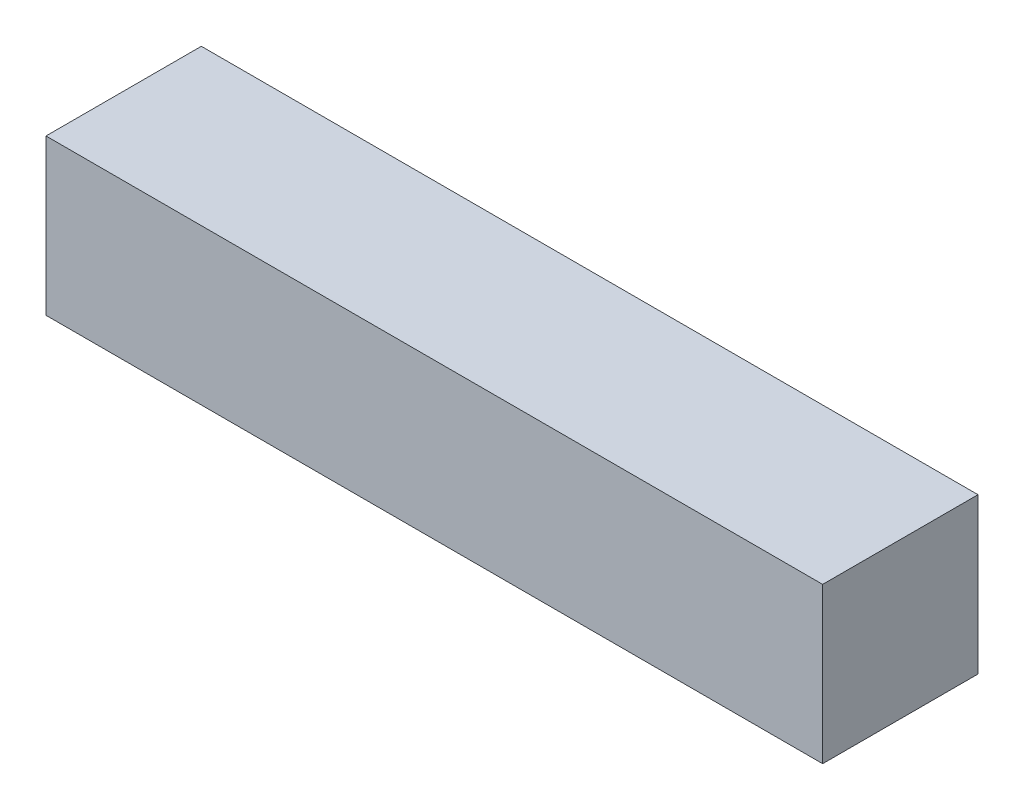
ISO-10303-21;
HEADER;
FILE_DESCRIPTION(('STEP AP214'),'2;1');
FILE_NAME('part.step','',(''),(''),'','','');
FILE_SCHEMA(('AUTOMOTIVE_DESIGN { 1 0 10303 214 1 1 1 1 }'));
ENDSEC;
DATA;
#1=APPLICATION_CONTEXT('core data for automotive mechanical design processes');
#2=APPLICATION_PROTOCOL_DEFINITION('international standard','automotive_design',2000,#1);
#3=PRODUCT_CONTEXT('',#1,'mechanical');
#4=PRODUCT('Part','Part','',(#3));
#5=PRODUCT_RELATED_PRODUCT_CATEGORY('part','',(#4));
#6=PRODUCT_DEFINITION_FORMATION('','',#4);
#7=PRODUCT_DEFINITION_CONTEXT('part definition',#1,'design');
#8=PRODUCT_DEFINITION('design','',#6,#7);
#9=PRODUCT_DEFINITION_SHAPE('','',#8);
#10=(LENGTH_UNIT() NAMED_UNIT(*) SI_UNIT(.MILLI.,.METRE.));
#11=(NAMED_UNIT(*) PLANE_ANGLE_UNIT() SI_UNIT($,.RADIAN.));
#12=(NAMED_UNIT(*) SI_UNIT($,.STERADIAN.) SOLID_ANGLE_UNIT());
#13=UNCERTAINTY_MEASURE_WITH_UNIT(LENGTH_MEASURE(1.E-05),#10,'distance_accuracy_value','');
#14=(GEOMETRIC_REPRESENTATION_CONTEXT(3) GLOBAL_UNCERTAINTY_ASSIGNED_CONTEXT((#13)) GLOBAL_UNIT_ASSIGNED_CONTEXT((#10,
#11,#12)) REPRESENTATION_CONTEXT('',''));
#15=CARTESIAN_POINT('',(0.,0.,0.));
#16=DIRECTION('',(0.,0.,1.));
#17=DIRECTION('',(1.,0.,0.));
#18=AXIS2_PLACEMENT_3D('',#15,#16,#17);
#19=CARTESIAN_POINT('',(127.,-12.7,-12.7));
#20=DIRECTION('',(0.,0.,1.));
#21=DIRECTION('',(1.,0.,0.));
#22=AXIS2_PLACEMENT_3D('',#19,#20,#21);
#23=PLANE('',#22);
#24=DIRECTION('',(0.,1.,0.));
#25=VECTOR('',#24,1.);
#26=CARTESIAN_POINT('',(0.,-12.7,-12.7));
#27=LINE('',#26,#25);
#28=CARTESIAN_POINT('',(0.,-12.7,-12.7));
#29=VERTEX_POINT('',#28);
#30=CARTESIAN_POINT('',(0.,12.7,-12.7));
#31=VERTEX_POINT('',#30);
#32=EDGE_CURVE('E95',#29,#31,#27,.T.);
#33=ORIENTED_EDGE('',*,*,#32,.T.);
#34=DIRECTION('',(-1.,0.,0.));
#35=VECTOR('',#34,1.);
#36=CARTESIAN_POINT('',(127.,12.7,-12.7));
#37=LINE('',#36,#35);
#38=CARTESIAN_POINT('',(127.,12.7,-12.7));
#39=VERTEX_POINT('',#38);
#40=EDGE_CURVE('E11',#39,#31,#37,.T.);
#41=ORIENTED_EDGE('',*,*,#40,.F.);
#42=DIRECTION('',(0.,1.,0.));
#43=VECTOR('',#42,1.);
#44=CARTESIAN_POINT('',(127.,-12.7,-12.7));
#45=LINE('',#44,#43);
#46=CARTESIAN_POINT('',(127.,-12.7,-12.7));
#47=VERTEX_POINT('',#46);
#48=EDGE_CURVE('E83',#47,#39,#45,.T.);
#49=ORIENTED_EDGE('',*,*,#48,.F.);
#50=DIRECTION('',(-1.,0.,0.));
#51=VECTOR('',#50,1.);
#52=CARTESIAN_POINT('',(127.,-12.7,-12.7));
#53=LINE('',#52,#51);
#54=EDGE_CURVE('E91',#47,#29,#53,.T.);
#55=ORIENTED_EDGE('',*,*,#54,.T.);
#56=EDGE_LOOP('',(#33,#41,#49,#55));
#57=FACE_BOUND('',#56,.T.);
#58=ADVANCED_FACE('F32',(#57),#23,.F.);
#59=CARTESIAN_POINT('',(127.,12.7,12.7));
#60=DIRECTION('',(0.,-1.,0.));
#61=DIRECTION('',(0.,0.,-1.));
#62=AXIS2_PLACEMENT_3D('',#59,#60,#61);
#63=PLANE('',#62);
#64=DIRECTION('',(0.,0.,1.));
#65=VECTOR('',#64,1.);
#66=CARTESIAN_POINT('',(0.,12.7,12.7));
#67=LINE('',#66,#65);
#68=CARTESIAN_POINT('',(0.,12.7,12.7));
#69=VERTEX_POINT('',#68);
#70=EDGE_CURVE('E87',#31,#69,#67,.T.);
#71=ORIENTED_EDGE('',*,*,#70,.T.);
#72=DIRECTION('',(-1.,0.,0.));
#73=VECTOR('',#72,1.);
#74=CARTESIAN_POINT('',(127.,12.7,12.7));
#75=LINE('',#74,#73);
#76=CARTESIAN_POINT('',(127.,12.7,12.7));
#77=VERTEX_POINT('',#76);
#78=EDGE_CURVE('E40',#77,#69,#75,.T.);
#79=ORIENTED_EDGE('',*,*,#78,.F.);
#80=DIRECTION('',(0.,0.,1.));
#81=VECTOR('',#80,1.);
#82=CARTESIAN_POINT('',(127.,12.7,12.7));
#83=LINE('',#82,#81);
#84=EDGE_CURVE('E78',#39,#77,#83,.T.);
#85=ORIENTED_EDGE('',*,*,#84,.F.);
#86=ORIENTED_EDGE('',*,*,#40,.T.);
#87=EDGE_LOOP('',(#71,#79,#85,#86));
#88=FACE_BOUND('',#87,.T.);
#89=ADVANCED_FACE('F86',(#88),#63,.F.);
#90=CARTESIAN_POINT('',(127.,-12.7,12.7));
#91=DIRECTION('',(0.,0.,-1.));
#92=DIRECTION('',(-1.,0.,0.));
#93=AXIS2_PLACEMENT_3D('',#90,#91,#92);
#94=PLANE('',#93);
#95=DIRECTION('',(0.,-1.,0.));
#96=VECTOR('',#95,1.);
#97=CARTESIAN_POINT('',(0.,-12.7,12.7));
#98=LINE('',#97,#96);
#99=CARTESIAN_POINT('',(0.,-12.7,12.7));
#100=VERTEX_POINT('',#99);
#101=EDGE_CURVE('E65',#69,#100,#98,.T.);
#102=ORIENTED_EDGE('',*,*,#101,.T.);
#103=DIRECTION('',(-1.,0.,0.));
#104=VECTOR('',#103,1.);
#105=CARTESIAN_POINT('',(127.,-12.7,12.7));
#106=LINE('',#105,#104);
#107=CARTESIAN_POINT('',(127.,-12.7,12.7));
#108=VERTEX_POINT('',#107);
#109=EDGE_CURVE('E88',#108,#100,#106,.T.);
#110=ORIENTED_EDGE('',*,*,#109,.F.);
#111=DIRECTION('',(0.,-1.,0.));
#112=VECTOR('',#111,1.);
#113=CARTESIAN_POINT('',(127.,-12.7,12.7));
#114=LINE('',#113,#112);
#115=EDGE_CURVE('E81',#77,#108,#114,.T.);
#116=ORIENTED_EDGE('',*,*,#115,.F.);
#117=ORIENTED_EDGE('',*,*,#78,.T.);
#118=EDGE_LOOP('',(#102,#110,#116,#117));
#119=FACE_BOUND('',#118,.T.);
#120=ADVANCED_FACE('F89',(#119),#94,.F.);
#121=CARTESIAN_POINT('',(127.,-12.7,12.7));
#122=DIRECTION('',(0.,1.,0.));
#123=DIRECTION('',(0.,0.,1.));
#124=AXIS2_PLACEMENT_3D('',#121,#122,#123);
#125=PLANE('',#124);
#126=DIRECTION('',(0.,0.,-1.));
#127=VECTOR('',#126,1.);
#128=CARTESIAN_POINT('',(0.,-12.7,12.7));
#129=LINE('',#128,#127);
#130=EDGE_CURVE('E71',#100,#29,#129,.T.);
#131=ORIENTED_EDGE('',*,*,#130,.T.);
#132=ORIENTED_EDGE('',*,*,#54,.F.);
#133=DIRECTION('',(0.,0.,-1.));
#134=VECTOR('',#133,1.);
#135=CARTESIAN_POINT('',(127.,-12.7,12.7));
#136=LINE('',#135,#134);
#137=EDGE_CURVE('E48',#108,#47,#136,.T.);
#138=ORIENTED_EDGE('',*,*,#137,.F.);
#139=ORIENTED_EDGE('',*,*,#109,.T.);
#140=EDGE_LOOP('',(#131,#132,#138,#139));
#141=FACE_BOUND('',#140,.T.);
#142=ADVANCED_FACE('F102',(#141),#125,.F.);
#143=CARTESIAN_POINT('',(127.,12.7,-12.7));
#144=DIRECTION('',(-1.,0.,0.));
#145=DIRECTION('',(0.,0.,1.));
#146=AXIS2_PLACEMENT_3D('',#143,#144,#145);
#147=PLANE('',#146);
#148=ORIENTED_EDGE('',*,*,#48,.T.);
#149=ORIENTED_EDGE('',*,*,#84,.T.);
#150=ORIENTED_EDGE('',*,*,#115,.T.);
#151=ORIENTED_EDGE('',*,*,#137,.T.);
#152=EDGE_LOOP('',(#148,#149,#150,#151));
#153=FACE_BOUND('',#152,.T.);
#154=ADVANCED_FACE('F79',(#153),#147,.F.);
#155=CARTESIAN_POINT('',(0.,12.7,-12.7));
#156=DIRECTION('',(-1.,0.,0.));
#157=DIRECTION('',(0.,0.,1.));
#158=AXIS2_PLACEMENT_3D('',#155,#156,#157);
#159=PLANE('',#158);
#160=ORIENTED_EDGE('',*,*,#32,.F.);
#161=ORIENTED_EDGE('',*,*,#130,.F.);
#162=ORIENTED_EDGE('',*,*,#101,.F.);
#163=ORIENTED_EDGE('',*,*,#70,.F.);
#164=EDGE_LOOP('',(#160,#161,#162,#163));
#165=FACE_BOUND('',#164,.T.);
#166=ADVANCED_FACE('F105',(#165),#159,.T.);
#167=CLOSED_SHELL('',(#58,#89,#120,#142,#154,#166));
#168=MANIFOLD_SOLID_BREP('B2',#167);
#169=ADVANCED_BREP_SHAPE_REPRESENTATION('',(#18,#168),#14);
#170=SHAPE_DEFINITION_REPRESENTATION(#9,#169);
ENDSEC;
END-ISO-10303-21;
